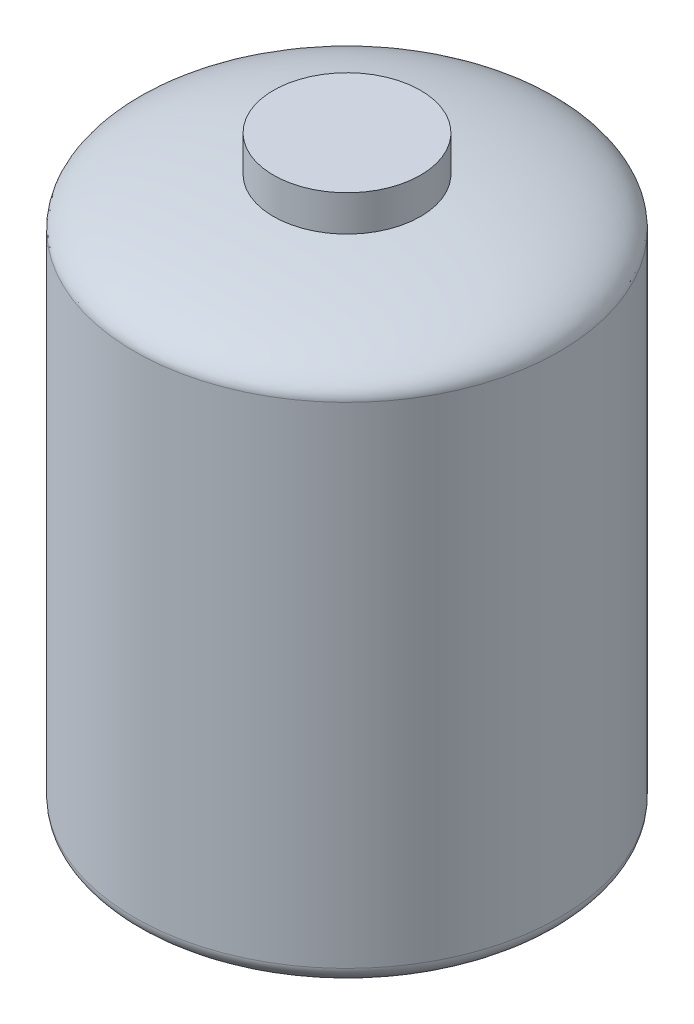
ISO-10303-21;
HEADER;
FILE_DESCRIPTION(('STEP AP214'),'2;1');
FILE_NAME('part.step','',(''),(''),'','','');
FILE_SCHEMA(('AUTOMOTIVE_DESIGN { 1 0 10303 214 1 1 1 1 }'));
ENDSEC;
DATA;
#1=APPLICATION_CONTEXT('core data for automotive mechanical design processes');
#2=APPLICATION_PROTOCOL_DEFINITION('international standard','automotive_design',2000,#1);
#3=PRODUCT_CONTEXT('',#1,'mechanical');
#4=PRODUCT('Part','Part','',(#3));
#5=PRODUCT_RELATED_PRODUCT_CATEGORY('part','',(#4));
#6=PRODUCT_DEFINITION_FORMATION('','',#4);
#7=PRODUCT_DEFINITION_CONTEXT('part definition',#1,'design');
#8=PRODUCT_DEFINITION('design','',#6,#7);
#9=PRODUCT_DEFINITION_SHAPE('','',#8);
#10=(LENGTH_UNIT() NAMED_UNIT(*) SI_UNIT(.MILLI.,.METRE.));
#11=(NAMED_UNIT(*) PLANE_ANGLE_UNIT() SI_UNIT($,.RADIAN.));
#12=(NAMED_UNIT(*) SI_UNIT($,.STERADIAN.) SOLID_ANGLE_UNIT());
#13=UNCERTAINTY_MEASURE_WITH_UNIT(LENGTH_MEASURE(1.E-05),#10,'distance_accuracy_value','');
#14=(GEOMETRIC_REPRESENTATION_CONTEXT(3) GLOBAL_UNCERTAINTY_ASSIGNED_CONTEXT((#13)) GLOBAL_UNIT_ASSIGNED_CONTEXT((#10,
#11,#12)) REPRESENTATION_CONTEXT('',''));
#15=CARTESIAN_POINT('',(0.,0.,0.));
#16=DIRECTION('',(0.,0.,1.));
#17=DIRECTION('',(1.,0.,0.));
#18=AXIS2_PLACEMENT_3D('',#15,#16,#17);
#19=CARTESIAN_POINT('',(0.,658.714164829699,0.));
#20=DIRECTION('',(0.,0.,1.));
#21=DIRECTION('',(1.,0.,0.));
#22=AXIS2_PLACEMENT_3D('',#19,#20,#21);
#23=ELLIPSE('',#22,650.,155.);
#24=TRIMMED_CURVE('',#23,(PARAMETER_VALUE(1.5707963267949)),(PARAMETER_VALUE(4.71238898038469)),
.T.,.PARAMETER.);
#25=CARTESIAN_POINT('',(0.,-996.285835170301,0.));
#26=DIRECTION('',(0.,-1.,0.));
#27=AXIS1_PLACEMENT('',#25,#26);
#28=SURFACE_OF_REVOLUTION('',#24,#27);
#29=CARTESIAN_POINT('',(0.,658.714164829699,0.));
#30=DIRECTION('',(0.,-1.,0.));
#31=DIRECTION('',(1.,0.,0.));
#32=AXIS2_PLACEMENT_3D('',#29,#30,#31);
#33=CIRCLE('',#32,650.);
#34=CARTESIAN_POINT('',(650.,658.714164829699,0.));
#35=VERTEX_POINT('',#34);
#36=EDGE_CURVE('E61',#35,#35,#33,.T.);
#37=ORIENTED_EDGE('',*,*,#36,.F.);
#38=EDGE_LOOP('',(#37));
#39=FACE_BOUND('',#38,.T.);
#40=CARTESIAN_POINT('',(0.,804.131718078608,0.));
#41=DIRECTION('',(0.,-1.,0.));
#42=DIRECTION('',(1.,0.,0.));
#43=AXIS2_PLACEMENT_3D('',#40,#41,#42);
#44=CIRCLE('',#43,225.);
#45=CARTESIAN_POINT('',(225.,804.131718078608,0.));
#46=VERTEX_POINT('',#45);
#47=EDGE_CURVE('E11',#46,#46,#44,.T.);
#48=ORIENTED_EDGE('',*,*,#47,.T.);
#49=EDGE_LOOP('',(#48));
#50=FACE_BOUND('',#49,.T.);
#51=ADVANCED_FACE('F39',(#39,#50),#28,.T.);
#52=CARTESIAN_POINT('',(0.,-996.285835170301,0.));
#53=DIRECTION('',(0.,-1.,0.));
#54=DIRECTION('',(1.,0.,0.));
#55=AXIS2_PLACEMENT_3D('',#52,#53,#54);
#56=CYLINDRICAL_SURFACE('',#55,225.);
#57=ORIENTED_EDGE('',*,*,#47,.F.);
#58=EDGE_LOOP('',(#57));
#59=FACE_BOUND('',#58,.T.);
#60=CARTESIAN_POINT('',(0.,913.714164829699,0.));
#61=DIRECTION('',(0.,-1.,0.));
#62=DIRECTION('',(1.,0.,0.));
#63=AXIS2_PLACEMENT_3D('',#60,#61,#62);
#64=CIRCLE('',#63,225.);
#65=CARTESIAN_POINT('',(225.,913.714164829699,0.));
#66=VERTEX_POINT('',#65);
#67=EDGE_CURVE('E47',#66,#66,#64,.T.);
#68=ORIENTED_EDGE('',*,*,#67,.T.);
#69=EDGE_LOOP('',(#68));
#70=FACE_BOUND('',#69,.T.);
#71=ADVANCED_FACE('F74',(#59,#70),#56,.T.);
#72=CARTESIAN_POINT('',(0.,913.714164829699,0.));
#73=DIRECTION('',(0.,-1.,0.));
#74=DIRECTION('',(1.,0.,0.));
#75=AXIS2_PLACEMENT_3D('',#72,#73,#74);
#76=PLANE('',#75);
#77=ORIENTED_EDGE('',*,*,#67,.F.);
#78=EDGE_LOOP('',(#77));
#79=FACE_BOUND('',#78,.T.);
#80=ADVANCED_FACE('F54',(#79),#76,.F.);
#81=CARTESIAN_POINT('',(0.,-841.285835170301,0.));
#82=DIRECTION('',(0.,0.,1.));
#83=DIRECTION('',(1.,0.,0.));
#84=AXIS2_PLACEMENT_3D('',#81,#82,#83);
#85=ELLIPSE('',#84,650.,155.);
#86=TRIMMED_CURVE('',#85,(PARAMETER_VALUE(1.5707963267949)),(PARAMETER_VALUE(4.71238898038469)),
.T.,.PARAMETER.);
#87=CARTESIAN_POINT('',(0.,-996.285835170301,0.));
#88=DIRECTION('',(0.,-1.,0.));
#89=AXIS1_PLACEMENT('',#87,#88);
#90=SURFACE_OF_REVOLUTION('',#86,#89);
#91=CARTESIAN_POINT('',(-1.19403062916867E-13,-996.285835170301,0.));
#92=VERTEX_POINT('',#91);
#93=VERTEX_LOOP('',#92);
#94=FACE_BOUND('',#93,.T.);
#95=CARTESIAN_POINT('',(0.,-841.285835170301,0.));
#96=DIRECTION('',(0.,-1.,0.));
#97=DIRECTION('',(1.,0.,0.));
#98=AXIS2_PLACEMENT_3D('',#95,#96,#97);
#99=CIRCLE('',#98,650.);
#100=CARTESIAN_POINT('',(650.,-841.285835170301,0.));
#101=VERTEX_POINT('',#100);
#102=EDGE_CURVE('E58',#101,#101,#99,.T.);
#103=ORIENTED_EDGE('',*,*,#102,.T.);
#104=EDGE_LOOP('',(#103));
#105=FACE_BOUND('',#104,.T.);
#106=ADVANCED_FACE('F50',(#94,#105),#90,.T.);
#107=CARTESIAN_POINT('',(0.,-996.285835170301,0.));
#108=DIRECTION('',(0.,-1.,0.));
#109=DIRECTION('',(1.,0.,0.));
#110=AXIS2_PLACEMENT_3D('',#107,#108,#109);
#111=CYLINDRICAL_SURFACE('',#110,650.);
#112=ORIENTED_EDGE('',*,*,#102,.F.);
#113=EDGE_LOOP('',(#112));
#114=FACE_BOUND('',#113,.T.);
#115=ORIENTED_EDGE('',*,*,#36,.T.);
#116=EDGE_LOOP('',(#115));
#117=FACE_BOUND('',#116,.T.);
#118=ADVANCED_FACE('F53',(#114,#117),#111,.T.);
#119=CLOSED_SHELL('',(#51,#71,#80,#106,#118));
#120=MANIFOLD_SOLID_BREP('B2',#119);
#121=ADVANCED_BREP_SHAPE_REPRESENTATION('',(#18,#120),#14);
#122=SHAPE_DEFINITION_REPRESENTATION(#9,#121);
ENDSEC;
END-ISO-10303-21;
